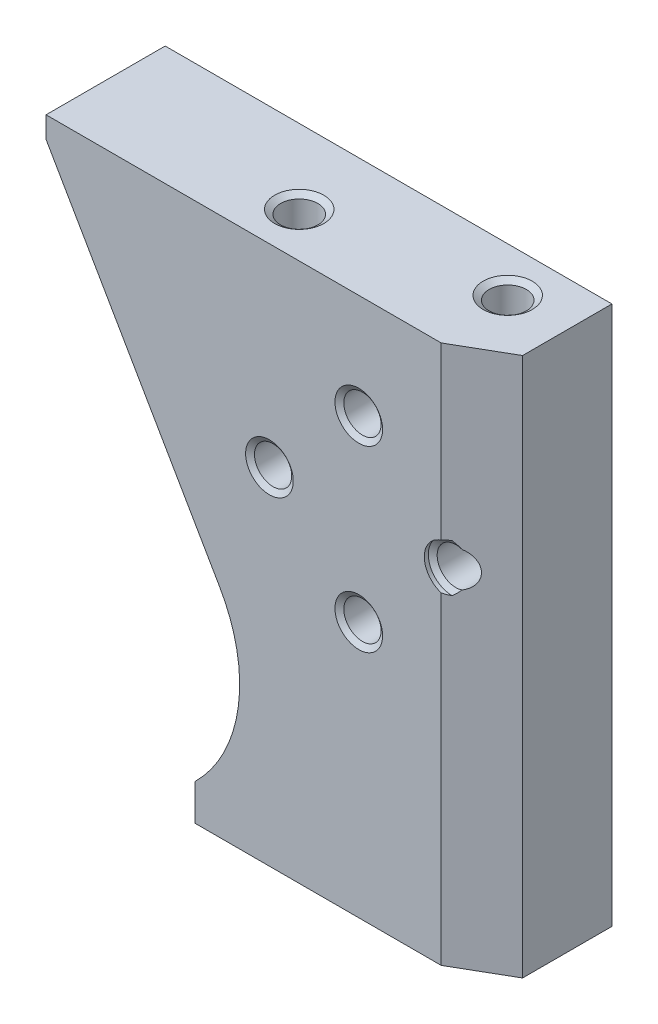
ISO-10303-21;
HEADER;
FILE_DESCRIPTION(('STEP AP214'),'2;1');
FILE_NAME('part.step','',(''),(''),'','','');
FILE_SCHEMA(('AUTOMOTIVE_DESIGN { 1 0 10303 214 1 1 1 1 }'));
ENDSEC;
DATA;
#1=APPLICATION_CONTEXT('core data for automotive mechanical design processes');
#2=APPLICATION_PROTOCOL_DEFINITION('international standard','automotive_design',2000,#1);
#3=PRODUCT_CONTEXT('',#1,'mechanical');
#4=PRODUCT('Part','Part','',(#3));
#5=PRODUCT_RELATED_PRODUCT_CATEGORY('part','',(#4));
#6=PRODUCT_DEFINITION_FORMATION('','',#4);
#7=PRODUCT_DEFINITION_CONTEXT('part definition',#1,'design');
#8=PRODUCT_DEFINITION('design','',#6,#7);
#9=PRODUCT_DEFINITION_SHAPE('','',#8);
#10=(LENGTH_UNIT() NAMED_UNIT(*) SI_UNIT(.MILLI.,.METRE.));
#11=(NAMED_UNIT(*) PLANE_ANGLE_UNIT() SI_UNIT($,.RADIAN.));
#12=(NAMED_UNIT(*) SI_UNIT($,.STERADIAN.) SOLID_ANGLE_UNIT());
#13=UNCERTAINTY_MEASURE_WITH_UNIT(LENGTH_MEASURE(1.E-05),#10,'distance_accuracy_value','');
#14=(GEOMETRIC_REPRESENTATION_CONTEXT(3) GLOBAL_UNCERTAINTY_ASSIGNED_CONTEXT((#13)) GLOBAL_UNIT_ASSIGNED_CONTEXT((#10,
#11,#12)) REPRESENTATION_CONTEXT('',''));
#15=CARTESIAN_POINT('',(0.,0.,0.));
#16=DIRECTION('',(0.,0.,1.));
#17=DIRECTION('',(1.,0.,0.));
#18=AXIS2_PLACEMENT_3D('',#15,#16,#17);
#19=CARTESIAN_POINT('',(0.,0.,8.));
#20=DIRECTION('',(1.,0.,0.));
#21=DIRECTION('',(0.,0.,-1.));
#22=AXIS2_PLACEMENT_3D('',#19,#20,#21);
#23=PLANE('',#22);
#24=DIRECTION('',(0.,-1.,0.));
#25=VECTOR('',#24,1.);
#26=CARTESIAN_POINT('',(0.,0.,0.));
#27=LINE('',#26,#25);
#28=CARTESIAN_POINT('',(0.,36.2,0.));
#29=VERTEX_POINT('',#28);
#30=CARTESIAN_POINT('',(0.,34.7661524227067,0.));
#31=VERTEX_POINT('',#30);
#32=EDGE_CURVE('E188',#29,#31,#27,.T.);
#33=ORIENTED_EDGE('',*,*,#32,.T.);
#34=DIRECTION('',(0.,0.,-1.));
#35=VECTOR('',#34,1.);
#36=CARTESIAN_POINT('',(0.,34.7661524227067,8.));
#37=LINE('',#36,#35);
#38=CARTESIAN_POINT('',(0.,34.7661524227067,8.));
#39=VERTEX_POINT('',#38);
#40=EDGE_CURVE('E192',#39,#31,#37,.T.);
#41=ORIENTED_EDGE('',*,*,#40,.F.);
#42=DIRECTION('',(0.,-1.,0.));
#43=VECTOR('',#42,1.);
#44=CARTESIAN_POINT('',(0.,0.,8.));
#45=LINE('',#44,#43);
#46=CARTESIAN_POINT('',(0.,36.2,8.));
#47=VERTEX_POINT('',#46);
#48=EDGE_CURVE('E179',#47,#39,#45,.T.);
#49=ORIENTED_EDGE('',*,*,#48,.F.);
#50=DIRECTION('',(0.,0.,-1.));
#51=VECTOR('',#50,1.);
#52=CARTESIAN_POINT('',(0.,36.2,8.));
#53=LINE('',#52,#51);
#54=EDGE_CURVE('E181',#47,#29,#53,.T.);
#55=ORIENTED_EDGE('',*,*,#54,.T.);
#56=EDGE_LOOP('',(#33,#41,#49,#55));
#57=FACE_BOUND('',#56,.T.);
#58=ADVANCED_FACE('F33',(#57),#23,.F.);
#59=CARTESIAN_POINT('',(0.,0.,8.));
#60=DIRECTION('',(0.,1.,0.));
#61=DIRECTION('',(0.,0.,1.));
#62=AXIS2_PLACEMENT_3D('',#59,#60,#61);
#63=PLANE('',#62);
#64=CARTESIAN_POINT('',(24.,0.,5.));
#65=DIRECTION('',(0.,-1.,0.));
#66=DIRECTION('',(0.,0.,-1.));
#67=AXIS2_PLACEMENT_3D('',#64,#65,#66);
#68=CIRCLE('',#67,1.65);
#69=CARTESIAN_POINT('',(24.,0.,3.35));
#70=VERTEX_POINT('',#69);
#71=EDGE_CURVE('E432',#70,#70,#68,.T.);
#72=ORIENTED_EDGE('',*,*,#71,.F.);
#73=EDGE_LOOP('',(#72));
#74=FACE_BOUND('',#73,.T.);
#75=CARTESIAN_POINT('',(15.,0.,5.));
#76=DIRECTION('',(0.,-1.,0.));
#77=DIRECTION('',(0.,0.,-1.));
#78=AXIS2_PLACEMENT_3D('',#75,#76,#77);
#79=CIRCLE('',#78,1.65);
#80=CARTESIAN_POINT('',(15.,0.,3.35));
#81=VERTEX_POINT('',#80);
#82=EDGE_CURVE('E441',#81,#81,#79,.T.);
#83=ORIENTED_EDGE('',*,*,#82,.F.);
#84=EDGE_LOOP('',(#83));
#85=FACE_BOUND('',#84,.T.);
#86=DIRECTION('',(0.,0.,-1.));
#87=VECTOR('',#86,1.);
#88=CARTESIAN_POINT('',(30.,0.,8.));
#89=LINE('',#88,#87);
#90=CARTESIAN_POINT('',(30.,0.,6.));
#91=VERTEX_POINT('',#90);
#92=CARTESIAN_POINT('',(30.,0.,0.));
#93=VERTEX_POINT('',#92);
#94=EDGE_CURVE('E153',#91,#93,#89,.T.);
#95=ORIENTED_EDGE('',*,*,#94,.F.);
#96=DIRECTION('',(0.866025403784438,0.,-0.500000000000001));
#97=VECTOR('',#96,1.);
#98=CARTESIAN_POINT('',(26.5358983848623,0.,8.));
#99=LINE('',#98,#97);
#100=CARTESIAN_POINT('',(26.5358983848623,0.,8.));
#101=VERTEX_POINT('',#100);
#102=EDGE_CURVE('E162',#91,#101,#99,.F.);
#103=ORIENTED_EDGE('',*,*,#102,.T.);
#104=DIRECTION('',(1.,0.,0.));
#105=VECTOR('',#104,1.);
#106=CARTESIAN_POINT('',(0.,0.,8.));
#107=LINE('',#106,#105);
#108=CARTESIAN_POINT('',(10.,0.,8.));
#109=VERTEX_POINT('',#108);
#110=EDGE_CURVE('E172',#109,#101,#107,.T.);
#111=ORIENTED_EDGE('',*,*,#110,.F.);
#112=DIRECTION('',(0.,0.,-1.));
#113=VECTOR('',#112,1.);
#114=CARTESIAN_POINT('',(10.,0.,8.));
#115=LINE('',#114,#113);
#116=CARTESIAN_POINT('',(10.,0.,0.));
#117=VERTEX_POINT('',#116);
#118=EDGE_CURVE('E236',#109,#117,#115,.T.);
#119=ORIENTED_EDGE('',*,*,#118,.T.);
#120=DIRECTION('',(1.,0.,0.));
#121=VECTOR('',#120,1.);
#122=CARTESIAN_POINT('',(0.,0.,0.));
#123=LINE('',#122,#121);
#124=EDGE_CURVE('E191',#117,#93,#123,.T.);
#125=ORIENTED_EDGE('',*,*,#124,.T.);
#126=EDGE_LOOP('',(#95,#103,#111,#119,#125));
#127=FACE_BOUND('',#126,.T.);
#128=ADVANCED_FACE('F245',(#74,#85,#127),#63,.F.);
#129=CARTESIAN_POINT('',(30.,0.,8.));
#130=DIRECTION('',(-1.,0.,0.));
#131=DIRECTION('',(0.,0.,1.));
#132=AXIS2_PLACEMENT_3D('',#129,#130,#131);
#133=PLANE('',#132);
#134=DIRECTION('',(0.,0.,-1.));
#135=VECTOR('',#134,1.);
#136=CARTESIAN_POINT('',(30.,36.2,8.));
#137=LINE('',#136,#135);
#138=CARTESIAN_POINT('',(30.,36.2,6.));
#139=VERTEX_POINT('',#138);
#140=CARTESIAN_POINT('',(30.,36.2,0.));
#141=VERTEX_POINT('',#140);
#142=EDGE_CURVE('E156',#139,#141,#137,.T.);
#143=ORIENTED_EDGE('',*,*,#142,.F.);
#144=DIRECTION('',(0.,-1.,0.));
#145=VECTOR('',#144,1.);
#146=CARTESIAN_POINT('',(30.,0.,6.));
#147=LINE('',#146,#145);
#148=EDGE_CURVE('E58',#139,#91,#147,.T.);
#149=ORIENTED_EDGE('',*,*,#148,.T.);
#150=ORIENTED_EDGE('',*,*,#94,.T.);
#151=DIRECTION('',(0.,1.,0.));
#152=VECTOR('',#151,1.);
#153=CARTESIAN_POINT('',(30.,0.,0.));
#154=LINE('',#153,#152);
#155=EDGE_CURVE('E195',#93,#141,#154,.T.);
#156=ORIENTED_EDGE('',*,*,#155,.T.);
#157=EDGE_LOOP('',(#143,#149,#150,#156));
#158=FACE_BOUND('',#157,.T.);
#159=ADVANCED_FACE('F205',(#158),#133,.F.);
#160=CARTESIAN_POINT('',(0.,36.2,8.));
#161=DIRECTION('',(0.,-1.,0.));
#162=DIRECTION('',(0.,0.,-1.));
#163=AXIS2_PLACEMENT_3D('',#160,#161,#162);
#164=PLANE('',#163);
#165=CARTESIAN_POINT('',(14.,36.2,5.));
#166=DIRECTION('',(0.,1.,0.));
#167=DIRECTION('',(0.,0.,1.));
#168=AXIS2_PLACEMENT_3D('',#165,#166,#167);
#169=CIRCLE('',#168,1.65);
#170=CARTESIAN_POINT('',(14.,36.2,6.65));
#171=VERTEX_POINT('',#170);
#172=EDGE_CURVE('E414',#171,#171,#169,.T.);
#173=ORIENTED_EDGE('',*,*,#172,.F.);
#174=EDGE_LOOP('',(#173));
#175=FACE_BOUND('',#174,.T.);
#176=CARTESIAN_POINT('',(26.,36.2,3.));
#177=DIRECTION('',(0.,1.,0.));
#178=DIRECTION('',(0.,0.,1.));
#179=AXIS2_PLACEMENT_3D('',#176,#177,#178);
#180=CIRCLE('',#179,1.65);
#181=CARTESIAN_POINT('',(26.,36.2,4.65));
#182=VERTEX_POINT('',#181);
#183=EDGE_CURVE('E423',#182,#182,#180,.T.);
#184=ORIENTED_EDGE('',*,*,#183,.F.);
#185=EDGE_LOOP('',(#184));
#186=FACE_BOUND('',#185,.T.);
#187=DIRECTION('',(-1.,0.,0.));
#188=VECTOR('',#187,1.);
#189=CARTESIAN_POINT('',(0.,36.2,8.));
#190=LINE('',#189,#188);
#191=CARTESIAN_POINT('',(26.5358983848623,36.2,8.));
#192=VERTEX_POINT('',#191);
#193=EDGE_CURVE('E178',#192,#47,#190,.T.);
#194=ORIENTED_EDGE('',*,*,#193,.F.);
#195=DIRECTION('',(-0.866025403784438,0.,0.500000000000001));
#196=VECTOR('',#195,1.);
#197=CARTESIAN_POINT('',(26.5358983848623,36.2,8.));
#198=LINE('',#197,#196);
#199=EDGE_CURVE('E149',#192,#139,#198,.F.);
#200=ORIENTED_EDGE('',*,*,#199,.T.);
#201=ORIENTED_EDGE('',*,*,#142,.T.);
#202=DIRECTION('',(-1.,0.,0.));
#203=VECTOR('',#202,1.);
#204=CARTESIAN_POINT('',(0.,36.2,0.));
#205=LINE('',#204,#203);
#206=EDGE_CURVE('E184',#141,#29,#205,.T.);
#207=ORIENTED_EDGE('',*,*,#206,.T.);
#208=ORIENTED_EDGE('',*,*,#54,.F.);
#209=EDGE_LOOP('',(#194,#200,#201,#207,#208));
#210=FACE_BOUND('',#209,.T.);
#211=ADVANCED_FACE('F201',(#175,#186,#210),#164,.F.);
#212=CARTESIAN_POINT('',(0.,36.2,8.));
#213=DIRECTION('',(0.,0.,-1.));
#214=DIRECTION('',(-1.,0.,0.));
#215=AXIS2_PLACEMENT_3D('',#212,#213,#214);
#216=PLANE('',#215);
#217=CARTESIAN_POINT('',(21.,29.2,8.));
#218=DIRECTION('',(0.,0.,-1.));
#219=DIRECTION('',(-1.,0.,0.));
#220=AXIS2_PLACEMENT_3D('',#217,#218,#219);
#221=CIRCLE('',#220,1.6);
#222=CARTESIAN_POINT('',(19.4,29.2,8.));
#223=VERTEX_POINT('',#222);
#224=EDGE_CURVE('E375',#223,#223,#221,.T.);
#225=ORIENTED_EDGE('',*,*,#224,.T.);
#226=EDGE_LOOP('',(#225));
#227=FACE_BOUND('',#226,.T.);
#228=CARTESIAN_POINT('',(21.,17.2,8.));
#229=DIRECTION('',(0.,0.,-1.));
#230=DIRECTION('',(-1.,0.,0.));
#231=AXIS2_PLACEMENT_3D('',#228,#229,#230);
#232=CIRCLE('',#231,1.6);
#233=CARTESIAN_POINT('',(19.4,17.2,8.));
#234=VERTEX_POINT('',#233);
#235=EDGE_CURVE('E384',#234,#234,#232,.T.);
#236=ORIENTED_EDGE('',*,*,#235,.T.);
#237=EDGE_LOOP('',(#236));
#238=FACE_BOUND('',#237,.T.);
#239=CARTESIAN_POINT('',(15.,23.2,8.));
#240=DIRECTION('',(0.,0.,-1.));
#241=DIRECTION('',(-1.,0.,0.));
#242=AXIS2_PLACEMENT_3D('',#239,#240,#241);
#243=CIRCLE('',#242,1.6);
#244=CARTESIAN_POINT('',(13.4,23.2,8.));
#245=VERTEX_POINT('',#244);
#246=EDGE_CURVE('E402',#245,#245,#243,.T.);
#247=ORIENTED_EDGE('',*,*,#246,.T.);
#248=EDGE_LOOP('',(#247));
#249=FACE_BOUND('',#248,.T.);
#250=DIRECTION('',(0.,1.,0.));
#251=VECTOR('',#250,1.);
#252=CARTESIAN_POINT('',(26.5358983848623,36.2,8.));
#253=LINE('',#252,#251);
#254=CARTESIAN_POINT('',(26.5358983848623,21.6687881626546,8.));
#255=VERTEX_POINT('',#254);
#256=EDGE_CURVE('E152',#101,#255,#253,.T.);
#257=ORIENTED_EDGE('',*,*,#256,.T.);
#258=CARTESIAN_POINT('',(27.,23.2,8.));
#259=DIRECTION('',(0.,0.,-1.));
#260=DIRECTION('',(-1.,0.,0.));
#261=AXIS2_PLACEMENT_3D('',#258,#259,#260);
#262=CIRCLE('',#261,1.6);
#263=CARTESIAN_POINT('',(26.5358983848623,24.7312118373454,8.));
#264=VERTEX_POINT('',#263);
#265=EDGE_CURVE('E50',#255,#264,#262,.T.);
#266=ORIENTED_EDGE('',*,*,#265,.T.);
#267=EDGE_CURVE('E148',#264,#192,#253,.T.);
#268=ORIENTED_EDGE('',*,*,#267,.T.);
#269=ORIENTED_EDGE('',*,*,#193,.T.);
#270=ORIENTED_EDGE('',*,*,#48,.T.);
#271=DIRECTION('',(0.499999999999998,-0.86602540378444,0.));
#272=VECTOR('',#271,1.);
#273=CARTESIAN_POINT('',(1.78896681474048,31.6675710065216,8.));
#274=LINE('',#273,#272);
#275=CARTESIAN_POINT('',(11.6602540378444,14.57,8.));
#276=VERTEX_POINT('',#275);
#277=EDGE_CURVE('E217',#39,#276,#274,.T.);
#278=ORIENTED_EDGE('',*,*,#277,.T.);
#279=CARTESIAN_POINT('',(3.,9.57,8.));
#280=DIRECTION('',(0.,0.,-1.));
#281=DIRECTION('',(-1.,0.,0.));
#282=AXIS2_PLACEMENT_3D('',#279,#280,#281);
#283=CIRCLE('',#282,10.);
#284=CARTESIAN_POINT('',(10.,2.42857157145715,8.));
#285=VERTEX_POINT('',#284);
#286=EDGE_CURVE('E219',#276,#285,#283,.T.);
#287=ORIENTED_EDGE('',*,*,#286,.T.);
#288=DIRECTION('',(0.,-1.,0.));
#289=VECTOR('',#288,1.);
#290=CARTESIAN_POINT('',(10.,18.1,8.));
#291=LINE('',#290,#289);
#292=EDGE_CURVE('E175',#285,#109,#291,.T.);
#293=ORIENTED_EDGE('',*,*,#292,.T.);
#294=ORIENTED_EDGE('',*,*,#110,.T.);
#295=EDGE_LOOP('',(#257,#266,#268,#269,#270,#278,#287,#293,#294));
#296=FACE_BOUND('',#295,.T.);
#297=ADVANCED_FACE('F169',(#227,#238,#249,#296),#216,.F.);
#298=CARTESIAN_POINT('',(0.,36.2,0.));
#299=DIRECTION('',(0.,0.,-1.));
#300=DIRECTION('',(-1.,0.,0.));
#301=AXIS2_PLACEMENT_3D('',#298,#299,#300);
#302=PLANE('',#301);
#303=CARTESIAN_POINT('',(21.,29.2,0.));
#304=DIRECTION('',(0.,0.,-1.));
#305=DIRECTION('',(-1.,0.,0.));
#306=AXIS2_PLACEMENT_3D('',#303,#304,#305);
#307=CIRCLE('',#306,1.6);
#308=CARTESIAN_POINT('',(19.4,29.2,0.));
#309=VERTEX_POINT('',#308);
#310=EDGE_CURVE('E374',#309,#309,#307,.T.);
#311=ORIENTED_EDGE('',*,*,#310,.F.);
#312=EDGE_LOOP('',(#311));
#313=FACE_BOUND('',#312,.T.);
#314=CARTESIAN_POINT('',(21.,17.2,0.));
#315=DIRECTION('',(0.,0.,-1.));
#316=DIRECTION('',(-1.,0.,0.));
#317=AXIS2_PLACEMENT_3D('',#314,#315,#316);
#318=CIRCLE('',#317,1.6);
#319=CARTESIAN_POINT('',(19.4,17.2,0.));
#320=VERTEX_POINT('',#319);
#321=EDGE_CURVE('E387',#320,#320,#318,.T.);
#322=ORIENTED_EDGE('',*,*,#321,.F.);
#323=EDGE_LOOP('',(#322));
#324=FACE_BOUND('',#323,.T.);
#325=CARTESIAN_POINT('',(27.,23.2,0.));
#326=DIRECTION('',(0.,0.,-1.));
#327=DIRECTION('',(-1.,0.,0.));
#328=AXIS2_PLACEMENT_3D('',#325,#326,#327);
#329=CIRCLE('',#328,1.6);
#330=CARTESIAN_POINT('',(25.4,23.2,0.));
#331=VERTEX_POINT('',#330);
#332=EDGE_CURVE('E143',#331,#331,#329,.T.);
#333=ORIENTED_EDGE('',*,*,#332,.F.);
#334=EDGE_LOOP('',(#333));
#335=FACE_BOUND('',#334,.T.);
#336=CARTESIAN_POINT('',(15.,23.2,0.));
#337=DIRECTION('',(0.,0.,-1.));
#338=DIRECTION('',(-1.,0.,0.));
#339=AXIS2_PLACEMENT_3D('',#336,#337,#338);
#340=CIRCLE('',#339,1.6);
#341=CARTESIAN_POINT('',(13.4,23.2,0.));
#342=VERTEX_POINT('',#341);
#343=EDGE_CURVE('E405',#342,#342,#340,.T.);
#344=ORIENTED_EDGE('',*,*,#343,.F.);
#345=EDGE_LOOP('',(#344));
#346=FACE_BOUND('',#345,.T.);
#347=DIRECTION('',(0.499999999999998,-0.86602540378444,0.));
#348=VECTOR('',#347,1.);
#349=CARTESIAN_POINT('',(1.78896681474048,31.6675710065216,0.));
#350=LINE('',#349,#348);
#351=CARTESIAN_POINT('',(11.6602540378444,14.57,0.));
#352=VERTEX_POINT('',#351);
#353=EDGE_CURVE('E212',#31,#352,#350,.T.);
#354=ORIENTED_EDGE('',*,*,#353,.F.);
#355=ORIENTED_EDGE('',*,*,#32,.F.);
#356=ORIENTED_EDGE('',*,*,#206,.F.);
#357=ORIENTED_EDGE('',*,*,#155,.F.);
#358=ORIENTED_EDGE('',*,*,#124,.F.);
#359=DIRECTION('',(0.,-1.,0.));
#360=VECTOR('',#359,1.);
#361=CARTESIAN_POINT('',(10.,18.1,0.));
#362=LINE('',#361,#360);
#363=CARTESIAN_POINT('',(10.,2.42857157145715,0.));
#364=VERTEX_POINT('',#363);
#365=EDGE_CURVE('E221',#364,#117,#362,.T.);
#366=ORIENTED_EDGE('',*,*,#365,.F.);
#367=CARTESIAN_POINT('',(3.,9.57,0.));
#368=DIRECTION('',(0.,0.,-1.));
#369=DIRECTION('',(-1.,0.,0.));
#370=AXIS2_PLACEMENT_3D('',#367,#368,#369);
#371=CIRCLE('',#370,10.);
#372=EDGE_CURVE('E224',#352,#364,#371,.T.);
#373=ORIENTED_EDGE('',*,*,#372,.F.);
#374=EDGE_LOOP('',(#354,#355,#356,#357,#358,#366,#373));
#375=FACE_BOUND('',#374,.T.);
#376=ADVANCED_FACE('F210',(#313,#324,#335,#346,#375),#302,.T.);
#377=CARTESIAN_POINT('',(1.78896681474048,31.6675710065216,8.));
#378=DIRECTION('',(0.86602540378444,0.499999999999998,0.));
#379=DIRECTION('',(-0.499999999999998,0.86602540378444,0.));
#380=AXIS2_PLACEMENT_3D('',#377,#378,#379);
#381=PLANE('',#380);
#382=ORIENTED_EDGE('',*,*,#353,.T.);
#383=DIRECTION('',(0.,0.,-1.));
#384=VECTOR('',#383,1.);
#385=CARTESIAN_POINT('',(11.6602540378444,14.57,8.));
#386=LINE('',#385,#384);
#387=EDGE_CURVE('E231',#276,#352,#386,.T.);
#388=ORIENTED_EDGE('',*,*,#387,.F.);
#389=ORIENTED_EDGE('',*,*,#277,.F.);
#390=ORIENTED_EDGE('',*,*,#40,.T.);
#391=EDGE_LOOP('',(#382,#388,#389,#390));
#392=FACE_BOUND('',#391,.T.);
#393=ADVANCED_FACE('F262',(#392),#381,.F.);
#394=CARTESIAN_POINT('',(10.,18.1,8.));
#395=DIRECTION('',(1.,0.,0.));
#396=DIRECTION('',(0.,0.,-1.));
#397=AXIS2_PLACEMENT_3D('',#394,#395,#396);
#398=PLANE('',#397);
#399=ORIENTED_EDGE('',*,*,#365,.T.);
#400=ORIENTED_EDGE('',*,*,#118,.F.);
#401=ORIENTED_EDGE('',*,*,#292,.F.);
#402=DIRECTION('',(0.,0.,-1.));
#403=VECTOR('',#402,1.);
#404=CARTESIAN_POINT('',(10.,2.42857157145715,8.));
#405=LINE('',#404,#403);
#406=EDGE_CURVE('E238',#285,#364,#405,.T.);
#407=ORIENTED_EDGE('',*,*,#406,.T.);
#408=EDGE_LOOP('',(#399,#400,#401,#407));
#409=FACE_BOUND('',#408,.T.);
#410=ADVANCED_FACE('F244',(#409),#398,.F.);
#411=CARTESIAN_POINT('',(3.,9.57,8.));
#412=DIRECTION('',(0.,0.,-1.));
#413=DIRECTION('',(-1.,0.,0.));
#414=AXIS2_PLACEMENT_3D('',#411,#412,#413);
#415=CYLINDRICAL_SURFACE('',#414,10.);
#416=ORIENTED_EDGE('',*,*,#372,.T.);
#417=ORIENTED_EDGE('',*,*,#406,.F.);
#418=ORIENTED_EDGE('',*,*,#286,.F.);
#419=ORIENTED_EDGE('',*,*,#387,.T.);
#420=EDGE_LOOP('',(#416,#417,#418,#419));
#421=FACE_BOUND('',#420,.T.);
#422=ADVANCED_FACE('F241',(#421),#415,.F.);
#423=CARTESIAN_POINT('',(26.5358983848623,36.2,8.));
#424=DIRECTION('',(-0.500000000000001,0.,-0.866025403784438));
#425=DIRECTION('',(-0.866025403784438,0.,0.500000000000001));
#426=AXIS2_PLACEMENT_3D('',#423,#424,#425);
#427=PLANE('',#426);
#428=CARTESIAN_POINT('',(27.,23.2,7.73205080756889));
#429=DIRECTION('',(-0.500000000000001,0.,-0.866025403784438));
#430=DIRECTION('',(0.866025403784438,0.,-0.500000000000001));
#431=AXIS2_PLACEMENT_3D('',#428,#429,#430);
#432=ELLIPSE('',#431,1.8475208614068,1.6);
#433=CARTESIAN_POINT('',(27.,24.8,7.73205080756889));
#434=VERTEX_POINT('',#433);
#435=EDGE_CURVE('E11',#434,#264,#432,.F.);
#436=ORIENTED_EDGE('',*,*,#435,.F.);
#437=CARTESIAN_POINT('',(22.878980024513,23.2,10.1113227997522));
#438=DIRECTION('',(-0.500000000000001,0.,-0.866025403784438));
#439=DIRECTION('',(-0.866025403784438,0.,0.500000000000001));
#440=AXIS2_PLACEMENT_3D('',#437,#438,#439);
#441=ELLIPSE('',#440,5.77113850389763,2.8278479600244);
#442=CARTESIAN_POINT('',(27.4244782612077,24.3757202923154,7.48697816919549));
#443=VERTEX_POINT('',#442);
#444=EDGE_CURVE('E42',#443,#434,#441,.F.);
#445=ORIENTED_EDGE('',*,*,#444,.F.);
#446=CARTESIAN_POINT('',(27.,23.2,7.73205080756889));
#447=DIRECTION('',(-0.500000000000001,0.,-0.866025403784438));
#448=DIRECTION('',(0.866025403784438,0.,-0.500000000000001));
#449=AXIS2_PLACEMENT_3D('',#446,#447,#448);
#450=ELLIPSE('',#449,1.44337567297407,1.25);
#451=CARTESIAN_POINT('',(27.4244782612077,22.0242797076847,7.48697816919549));
#452=VERTEX_POINT('',#451);
#453=EDGE_CURVE('E37',#452,#443,#450,.F.);
#454=ORIENTED_EDGE('',*,*,#453,.F.);
#455=CARTESIAN_POINT('',(27.,21.6,7.73205080756889));
#456=VERTEX_POINT('',#455);
#457=EDGE_CURVE('E141',#456,#452,#441,.F.);
#458=ORIENTED_EDGE('',*,*,#457,.F.);
#459=EDGE_CURVE('E44',#255,#456,#432,.F.);
#460=ORIENTED_EDGE('',*,*,#459,.F.);
#461=ORIENTED_EDGE('',*,*,#256,.F.);
#462=ORIENTED_EDGE('',*,*,#102,.F.);
#463=ORIENTED_EDGE('',*,*,#148,.F.);
#464=ORIENTED_EDGE('',*,*,#199,.F.);
#465=ORIENTED_EDGE('',*,*,#267,.F.);
#466=EDGE_LOOP('',(#436,#445,#454,#458,#460,#461,#462,#463,#464,#465));
#467=FACE_BOUND('',#466,.T.);
#468=ADVANCED_FACE('F35',(#467),#427,.F.);
#469=CARTESIAN_POINT('',(15.,10.5,5.));
#470=DIRECTION('',(0.,-1.,0.));
#471=DIRECTION('',(0.,0.,-1.));
#472=AXIS2_PLACEMENT_3D('',#469,#470,#471);
#473=CONICAL_SURFACE('',#472,1.24999999999999,1.02974425867665);
#474=CARTESIAN_POINT('',(15.,11.2510757737844,5.));
#475=VERTEX_POINT('',#474);
#476=VERTEX_LOOP('',#475);
#477=FACE_BOUND('',#476,.T.);
#478=CARTESIAN_POINT('',(15.,10.5,5.));
#479=DIRECTION('',(0.,-1.,0.));
#480=DIRECTION('',(0.,0.,-1.));
#481=AXIS2_PLACEMENT_3D('',#478,#479,#480);
#482=CIRCLE('',#481,1.24999999999999);
#483=CARTESIAN_POINT('',(15.,10.5,3.75000000000001));
#484=VERTEX_POINT('',#483);
#485=EDGE_CURVE('E227',#484,#484,#482,.T.);
#486=ORIENTED_EDGE('',*,*,#485,.T.);
#487=EDGE_LOOP('',(#486));
#488=FACE_BOUND('',#487,.T.);
#489=ADVANCED_FACE('F273',(#477,#488),#473,.F.);
#490=CARTESIAN_POINT('',(15.,0.,5.));
#491=DIRECTION('',(0.,-1.,0.));
#492=DIRECTION('',(0.,0.,-1.));
#493=AXIS2_PLACEMENT_3D('',#490,#491,#492);
#494=CYLINDRICAL_SURFACE('',#493,1.24999999999999);
#495=ORIENTED_EDGE('',*,*,#485,.F.);
#496=EDGE_LOOP('',(#495));
#497=FACE_BOUND('',#496,.T.);
#498=CARTESIAN_POINT('',(15.,0.280083015283884,5.));
#499=DIRECTION('',(0.,-1.,0.));
#500=DIRECTION('',(0.,0.,-1.));
#501=AXIS2_PLACEMENT_3D('',#498,#499,#500);
#502=CIRCLE('',#501,1.25);
#503=CARTESIAN_POINT('',(15.,0.280083015283884,3.75));
#504=VERTEX_POINT('',#503);
#505=EDGE_CURVE('E443',#504,#504,#502,.T.);
#506=ORIENTED_EDGE('',*,*,#505,.T.);
#507=EDGE_LOOP('',(#506));
#508=FACE_BOUND('',#507,.T.);
#509=ADVANCED_FACE('F276',(#497,#508),#494,.F.);
#510=CARTESIAN_POINT('',(15.,0.,5.));
#511=DIRECTION('',(0.,-1.,0.));
#512=DIRECTION('',(0.,0.,-1.));
#513=AXIS2_PLACEMENT_3D('',#510,#511,#512);
#514=CONICAL_SURFACE('',#513,1.65,0.959931088596879);
#515=ORIENTED_EDGE('',*,*,#505,.F.);
#516=EDGE_LOOP('',(#515));
#517=FACE_BOUND('',#516,.T.);
#518=ORIENTED_EDGE('',*,*,#82,.T.);
#519=EDGE_LOOP('',(#518));
#520=FACE_BOUND('',#519,.T.);
#521=ADVANCED_FACE('F280',(#517,#520),#514,.F.);
#522=CARTESIAN_POINT('',(24.,10.5,5.));
#523=DIRECTION('',(0.,-1.,0.));
#524=DIRECTION('',(0.,0.,-1.));
#525=AXIS2_PLACEMENT_3D('',#522,#523,#524);
#526=CONICAL_SURFACE('',#525,1.24999999999999,1.02974425867665);
#527=CARTESIAN_POINT('',(24.,11.2510757737844,5.));
#528=VERTEX_POINT('',#527);
#529=VERTEX_LOOP('',#528);
#530=FACE_BOUND('',#529,.T.);
#531=CARTESIAN_POINT('',(24.,10.5,5.));
#532=DIRECTION('',(0.,-1.,0.));
#533=DIRECTION('',(0.,0.,-1.));
#534=AXIS2_PLACEMENT_3D('',#531,#532,#533);
#535=CIRCLE('',#534,1.24999999999999);
#536=CARTESIAN_POINT('',(24.,10.5,3.75000000000001));
#537=VERTEX_POINT('',#536);
#538=EDGE_CURVE('E438',#537,#537,#535,.T.);
#539=ORIENTED_EDGE('',*,*,#538,.T.);
#540=EDGE_LOOP('',(#539));
#541=FACE_BOUND('',#540,.T.);
#542=ADVANCED_FACE('F284',(#530,#541),#526,.F.);
#543=CARTESIAN_POINT('',(24.,0.,5.));
#544=DIRECTION('',(0.,-1.,0.));
#545=DIRECTION('',(0.,0.,-1.));
#546=AXIS2_PLACEMENT_3D('',#543,#544,#545);
#547=CYLINDRICAL_SURFACE('',#546,1.24999999999999);
#548=ORIENTED_EDGE('',*,*,#538,.F.);
#549=EDGE_LOOP('',(#548));
#550=FACE_BOUND('',#549,.T.);
#551=CARTESIAN_POINT('',(24.,0.280083015283884,5.));
#552=DIRECTION('',(0.,-1.,0.));
#553=DIRECTION('',(0.,0.,-1.));
#554=AXIS2_PLACEMENT_3D('',#551,#552,#553);
#555=CIRCLE('',#554,1.25);
#556=CARTESIAN_POINT('',(24.,0.280083015283884,3.75));
#557=VERTEX_POINT('',#556);
#558=EDGE_CURVE('E435',#557,#557,#555,.T.);
#559=ORIENTED_EDGE('',*,*,#558,.T.);
#560=EDGE_LOOP('',(#559));
#561=FACE_BOUND('',#560,.T.);
#562=ADVANCED_FACE('F288',(#550,#561),#547,.F.);
#563=CARTESIAN_POINT('',(24.,0.,5.));
#564=DIRECTION('',(0.,-1.,0.));
#565=DIRECTION('',(0.,0.,-1.));
#566=AXIS2_PLACEMENT_3D('',#563,#564,#565);
#567=CONICAL_SURFACE('',#566,1.65,0.959931088596879);
#568=ORIENTED_EDGE('',*,*,#558,.F.);
#569=EDGE_LOOP('',(#568));
#570=FACE_BOUND('',#569,.T.);
#571=ORIENTED_EDGE('',*,*,#71,.T.);
#572=EDGE_LOOP('',(#571));
#573=FACE_BOUND('',#572,.T.);
#574=ADVANCED_FACE('F292',(#570,#573),#567,.F.);
#575=CARTESIAN_POINT('',(26.,26.2,3.));
#576=DIRECTION('',(0.,1.,0.));
#577=DIRECTION('',(0.,0.,1.));
#578=AXIS2_PLACEMENT_3D('',#575,#576,#577);
#579=CONICAL_SURFACE('',#578,1.25,1.02974425867665);
#580=CARTESIAN_POINT('',(26.,25.4489242262155,3.));
#581=VERTEX_POINT('',#580);
#582=VERTEX_LOOP('',#581);
#583=FACE_BOUND('',#582,.T.);
#584=CARTESIAN_POINT('',(26.,26.2,3.));
#585=DIRECTION('',(0.,1.,0.));
#586=DIRECTION('',(0.,0.,1.));
#587=AXIS2_PLACEMENT_3D('',#584,#585,#586);
#588=CIRCLE('',#587,1.25);
#589=CARTESIAN_POINT('',(26.,26.2,4.25));
#590=VERTEX_POINT('',#589);
#591=EDGE_CURVE('E429',#590,#590,#588,.T.);
#592=ORIENTED_EDGE('',*,*,#591,.T.);
#593=EDGE_LOOP('',(#592));
#594=FACE_BOUND('',#593,.T.);
#595=ADVANCED_FACE('F296',(#583,#594),#579,.F.);
#596=CARTESIAN_POINT('',(26.,36.2,3.));
#597=DIRECTION('',(0.,1.,0.));
#598=DIRECTION('',(0.,0.,1.));
#599=AXIS2_PLACEMENT_3D('',#596,#597,#598);
#600=CYLINDRICAL_SURFACE('',#599,1.24999999999999);
#601=ORIENTED_EDGE('',*,*,#591,.F.);
#602=EDGE_LOOP('',(#601));
#603=FACE_BOUND('',#602,.T.);
#604=CARTESIAN_POINT('',(26.,35.9199169847161,3.));
#605=DIRECTION('',(0.,1.,0.));
#606=DIRECTION('',(0.,0.,1.));
#607=AXIS2_PLACEMENT_3D('',#604,#605,#606);
#608=CIRCLE('',#607,1.24999999999999);
#609=CARTESIAN_POINT('',(26.,35.9199169847161,4.24999999999999));
#610=VERTEX_POINT('',#609);
#611=EDGE_CURVE('E426',#610,#610,#608,.T.);
#612=ORIENTED_EDGE('',*,*,#611,.T.);
#613=EDGE_LOOP('',(#612));
#614=FACE_BOUND('',#613,.T.);
#615=ADVANCED_FACE('F300',(#603,#614),#600,.F.);
#616=CARTESIAN_POINT('',(26.,36.2,3.));
#617=DIRECTION('',(0.,1.,0.));
#618=DIRECTION('',(0.,0.,1.));
#619=AXIS2_PLACEMENT_3D('',#616,#617,#618);
#620=CONICAL_SURFACE('',#619,1.65,0.959931088596868);
#621=ORIENTED_EDGE('',*,*,#611,.F.);
#622=EDGE_LOOP('',(#621));
#623=FACE_BOUND('',#622,.T.);
#624=ORIENTED_EDGE('',*,*,#183,.T.);
#625=EDGE_LOOP('',(#624));
#626=FACE_BOUND('',#625,.T.);
#627=ADVANCED_FACE('F304',(#623,#626),#620,.F.);
#628=CARTESIAN_POINT('',(14.,26.2,5.));
#629=DIRECTION('',(0.,1.,0.));
#630=DIRECTION('',(0.,0.,1.));
#631=AXIS2_PLACEMENT_3D('',#628,#629,#630);
#632=CONICAL_SURFACE('',#631,1.25,1.02974425867665);
#633=CARTESIAN_POINT('',(14.,25.4489242262155,5.));
#634=VERTEX_POINT('',#633);
#635=VERTEX_LOOP('',#634);
#636=FACE_BOUND('',#635,.T.);
#637=CARTESIAN_POINT('',(14.,26.2,5.));
#638=DIRECTION('',(0.,1.,0.));
#639=DIRECTION('',(0.,0.,1.));
#640=AXIS2_PLACEMENT_3D('',#637,#638,#639);
#641=CIRCLE('',#640,1.25);
#642=CARTESIAN_POINT('',(14.,26.2,6.25));
#643=VERTEX_POINT('',#642);
#644=EDGE_CURVE('E420',#643,#643,#641,.T.);
#645=ORIENTED_EDGE('',*,*,#644,.T.);
#646=EDGE_LOOP('',(#645));
#647=FACE_BOUND('',#646,.T.);
#648=ADVANCED_FACE('F308',(#636,#647),#632,.F.);
#649=CARTESIAN_POINT('',(14.,36.2,5.));
#650=DIRECTION('',(0.,1.,0.));
#651=DIRECTION('',(0.,0.,1.));
#652=AXIS2_PLACEMENT_3D('',#649,#650,#651);
#653=CYLINDRICAL_SURFACE('',#652,1.24999999999999);
#654=ORIENTED_EDGE('',*,*,#644,.F.);
#655=EDGE_LOOP('',(#654));
#656=FACE_BOUND('',#655,.T.);
#657=CARTESIAN_POINT('',(14.,35.9199169847161,5.));
#658=DIRECTION('',(0.,1.,0.));
#659=DIRECTION('',(0.,0.,1.));
#660=AXIS2_PLACEMENT_3D('',#657,#658,#659);
#661=CIRCLE('',#660,1.24999999999999);
#662=CARTESIAN_POINT('',(14.,35.9199169847161,6.24999999999999));
#663=VERTEX_POINT('',#662);
#664=EDGE_CURVE('E417',#663,#663,#661,.T.);
#665=ORIENTED_EDGE('',*,*,#664,.T.);
#666=EDGE_LOOP('',(#665));
#667=FACE_BOUND('',#666,.T.);
#668=ADVANCED_FACE('F312',(#656,#667),#653,.F.);
#669=CARTESIAN_POINT('',(14.,36.2,5.));
#670=DIRECTION('',(0.,1.,0.));
#671=DIRECTION('',(0.,0.,1.));
#672=AXIS2_PLACEMENT_3D('',#669,#670,#671);
#673=CONICAL_SURFACE('',#672,1.65,0.959931088596868);
#674=ORIENTED_EDGE('',*,*,#664,.F.);
#675=EDGE_LOOP('',(#674));
#676=FACE_BOUND('',#675,.T.);
#677=ORIENTED_EDGE('',*,*,#172,.T.);
#678=EDGE_LOOP('',(#677));
#679=FACE_BOUND('',#678,.T.);
#680=ADVANCED_FACE('F316',(#676,#679),#673,.F.);
#681=CARTESIAN_POINT('',(15.,23.2,7.75492736162661));
#682=DIRECTION('',(0.,0.,1.));
#683=DIRECTION('',(1.,0.,0.));
#684=AXIS2_PLACEMENT_3D('',#681,#682,#683);
#685=CONICAL_SURFACE('',#684,1.25,0.959931088596881);
#686=ORIENTED_EDGE('',*,*,#246,.F.);
#687=EDGE_LOOP('',(#686));
#688=FACE_BOUND('',#687,.T.);
#689=CARTESIAN_POINT('',(15.,23.2,7.75492736162661));
#690=DIRECTION('',(0.,0.,-1.));
#691=DIRECTION('',(-1.,0.,0.));
#692=AXIS2_PLACEMENT_3D('',#689,#690,#691);
#693=CIRCLE('',#692,1.25);
#694=CARTESIAN_POINT('',(13.75,23.2,7.75492736162661));
#695=VERTEX_POINT('',#694);
#696=EDGE_CURVE('E411',#695,#695,#693,.T.);
#697=ORIENTED_EDGE('',*,*,#696,.T.);
#698=EDGE_LOOP('',(#697));
#699=FACE_BOUND('',#698,.T.);
#700=ADVANCED_FACE('F320',(#688,#699),#685,.F.);
#701=CARTESIAN_POINT('',(15.,23.2,0.));
#702=DIRECTION('',(0.,0.,-1.));
#703=DIRECTION('',(-1.,0.,0.));
#704=AXIS2_PLACEMENT_3D('',#701,#702,#703);
#705=CYLINDRICAL_SURFACE('',#704,1.25);
#706=ORIENTED_EDGE('',*,*,#696,.F.);
#707=EDGE_LOOP('',(#706));
#708=FACE_BOUND('',#707,.T.);
#709=CARTESIAN_POINT('',(15.,23.2,0.245072638373398));
#710=DIRECTION('',(0.,0.,-1.));
#711=DIRECTION('',(-1.,0.,0.));
#712=AXIS2_PLACEMENT_3D('',#709,#710,#711);
#713=CIRCLE('',#712,1.25);
#714=CARTESIAN_POINT('',(13.75,23.2,0.245072638373398));
#715=VERTEX_POINT('',#714);
#716=EDGE_CURVE('E408',#715,#715,#713,.T.);
#717=ORIENTED_EDGE('',*,*,#716,.T.);
#718=EDGE_LOOP('',(#717));
#719=FACE_BOUND('',#718,.T.);
#720=ADVANCED_FACE('F324',(#708,#719),#705,.F.);
#721=CARTESIAN_POINT('',(15.,23.2,0.));
#722=DIRECTION('',(0.,0.,-1.));
#723=DIRECTION('',(-1.,0.,0.));
#724=AXIS2_PLACEMENT_3D('',#721,#722,#723);
#725=CONICAL_SURFACE('',#724,1.6,0.959931088596878);
#726=ORIENTED_EDGE('',*,*,#716,.F.);
#727=EDGE_LOOP('',(#726));
#728=FACE_BOUND('',#727,.T.);
#729=ORIENTED_EDGE('',*,*,#343,.T.);
#730=EDGE_LOOP('',(#729));
#731=FACE_BOUND('',#730,.T.);
#732=ADVANCED_FACE('F328',(#728,#731),#725,.F.);
#733=CARTESIAN_POINT('',(27.,23.2,7.48697816919549));
#734=DIRECTION('',(0.,0.,1.));
#735=DIRECTION('',(1.,0.,0.));
#736=AXIS2_PLACEMENT_3D('',#733,#734,#735);
#737=CONICAL_SURFACE('',#736,1.25,0.959931088596879);
#738=ORIENTED_EDGE('',*,*,#457,.T.);
#739=CARTESIAN_POINT('',(27.,23.2,7.48697816919549));
#740=DIRECTION('',(0.,0.,-1.));
#741=DIRECTION('',(-1.,0.,0.));
#742=AXIS2_PLACEMENT_3D('',#739,#740,#741);
#743=CIRCLE('',#742,1.25);
#744=EDGE_CURVE('E137',#452,#443,#743,.T.);
#745=ORIENTED_EDGE('',*,*,#744,.T.);
#746=ORIENTED_EDGE('',*,*,#444,.T.);
#747=CARTESIAN_POINT('',(27.,23.2,7.73205080756889));
#748=DIRECTION('',(0.,0.,-1.));
#749=DIRECTION('',(-1.,0.,0.));
#750=AXIS2_PLACEMENT_3D('',#747,#748,#749);
#751=CIRCLE('',#750,1.6);
#752=EDGE_CURVE('E134',#456,#434,#751,.T.);
#753=ORIENTED_EDGE('',*,*,#752,.F.);
#754=EDGE_LOOP('',(#738,#745,#746,#753));
#755=FACE_BOUND('',#754,.T.);
#756=ADVANCED_FACE('F133',(#755),#737,.F.);
#757=CARTESIAN_POINT('',(27.,23.2,0.));
#758=DIRECTION('',(0.,0.,-1.));
#759=DIRECTION('',(-1.,0.,0.));
#760=AXIS2_PLACEMENT_3D('',#757,#758,#759);
#761=CYLINDRICAL_SURFACE('',#760,1.25);
#762=ORIENTED_EDGE('',*,*,#453,.T.);
#763=ORIENTED_EDGE('',*,*,#744,.F.);
#764=EDGE_LOOP('',(#762,#763));
#765=FACE_BOUND('',#764,.T.);
#766=CARTESIAN_POINT('',(27.,23.2,0.245072638373398));
#767=DIRECTION('',(0.,0.,-1.));
#768=DIRECTION('',(-1.,0.,0.));
#769=AXIS2_PLACEMENT_3D('',#766,#767,#768);
#770=CIRCLE('',#769,1.25);
#771=CARTESIAN_POINT('',(25.75,23.2,0.245072638373398));
#772=VERTEX_POINT('',#771);
#773=EDGE_CURVE('E397',#772,#772,#770,.T.);
#774=ORIENTED_EDGE('',*,*,#773,.T.);
#775=EDGE_LOOP('',(#774));
#776=FACE_BOUND('',#775,.T.);
#777=ADVANCED_FACE('F164',(#765,#776),#761,.F.);
#778=CARTESIAN_POINT('',(27.,23.2,0.));
#779=DIRECTION('',(0.,0.,-1.));
#780=DIRECTION('',(-1.,0.,0.));
#781=AXIS2_PLACEMENT_3D('',#778,#779,#780);
#782=CONICAL_SURFACE('',#781,1.6,0.959931088596878);
#783=ORIENTED_EDGE('',*,*,#773,.F.);
#784=EDGE_LOOP('',(#783));
#785=FACE_BOUND('',#784,.T.);
#786=ORIENTED_EDGE('',*,*,#332,.T.);
#787=EDGE_LOOP('',(#786));
#788=FACE_BOUND('',#787,.T.);
#789=ADVANCED_FACE('F337',(#785,#788),#782,.F.);
#790=CARTESIAN_POINT('',(27.,23.2,7.73205080756889));
#791=DIRECTION('',(0.,0.,-1.));
#792=DIRECTION('',(-1.,0.,0.));
#793=AXIS2_PLACEMENT_3D('',#790,#791,#792);
#794=CYLINDRICAL_SURFACE('',#793,1.6);
#795=ORIENTED_EDGE('',*,*,#435,.T.);
#796=ORIENTED_EDGE('',*,*,#265,.F.);
#797=ORIENTED_EDGE('',*,*,#459,.T.);
#798=ORIENTED_EDGE('',*,*,#752,.T.);
#799=EDGE_LOOP('',(#795,#796,#797,#798));
#800=FACE_BOUND('',#799,.T.);
#801=ADVANCED_FACE('F142',(#800),#794,.F.);
#802=CARTESIAN_POINT('',(21.,17.2,7.7549273616266));
#803=DIRECTION('',(0.,0.,1.));
#804=DIRECTION('',(1.,0.,0.));
#805=AXIS2_PLACEMENT_3D('',#802,#803,#804);
#806=CONICAL_SURFACE('',#805,1.25,0.959931088596878);
#807=ORIENTED_EDGE('',*,*,#235,.F.);
#808=EDGE_LOOP('',(#807));
#809=FACE_BOUND('',#808,.T.);
#810=CARTESIAN_POINT('',(21.,17.2,7.7549273616266));
#811=DIRECTION('',(0.,0.,-1.));
#812=DIRECTION('',(-1.,0.,0.));
#813=AXIS2_PLACEMENT_3D('',#810,#811,#812);
#814=CIRCLE('',#813,1.25);
#815=CARTESIAN_POINT('',(19.75,17.2,7.7549273616266));
#816=VERTEX_POINT('',#815);
#817=EDGE_CURVE('E144',#816,#816,#814,.T.);
#818=ORIENTED_EDGE('',*,*,#817,.T.);
#819=EDGE_LOOP('',(#818));
#820=FACE_BOUND('',#819,.T.);
#821=ADVANCED_FACE('F343',(#809,#820),#806,.F.);
#822=CARTESIAN_POINT('',(21.,17.2,0.));
#823=DIRECTION('',(0.,0.,-1.));
#824=DIRECTION('',(-1.,0.,0.));
#825=AXIS2_PLACEMENT_3D('',#822,#823,#824);
#826=CYLINDRICAL_SURFACE('',#825,1.25);
#827=ORIENTED_EDGE('',*,*,#817,.F.);
#828=EDGE_LOOP('',(#827));
#829=FACE_BOUND('',#828,.T.);
#830=CARTESIAN_POINT('',(21.,17.2,0.245072638373398));
#831=DIRECTION('',(0.,0.,-1.));
#832=DIRECTION('',(-1.,0.,0.));
#833=AXIS2_PLACEMENT_3D('',#830,#831,#832);
#834=CIRCLE('',#833,1.25);
#835=CARTESIAN_POINT('',(19.75,17.2,0.245072638373398));
#836=VERTEX_POINT('',#835);
#837=EDGE_CURVE('E390',#836,#836,#834,.T.);
#838=ORIENTED_EDGE('',*,*,#837,.T.);
#839=EDGE_LOOP('',(#838));
#840=FACE_BOUND('',#839,.T.);
#841=ADVANCED_FACE('F346',(#829,#840),#826,.F.);
#842=CARTESIAN_POINT('',(21.,17.2,0.));
#843=DIRECTION('',(0.,0.,-1.));
#844=DIRECTION('',(-1.,0.,0.));
#845=AXIS2_PLACEMENT_3D('',#842,#843,#844);
#846=CONICAL_SURFACE('',#845,1.6,0.959931088596878);
#847=ORIENTED_EDGE('',*,*,#837,.F.);
#848=EDGE_LOOP('',(#847));
#849=FACE_BOUND('',#848,.T.);
#850=ORIENTED_EDGE('',*,*,#321,.T.);
#851=EDGE_LOOP('',(#850));
#852=FACE_BOUND('',#851,.T.);
#853=ADVANCED_FACE('F350',(#849,#852),#846,.F.);
#854=CARTESIAN_POINT('',(21.,29.2,7.7549273616266));
#855=DIRECTION('',(0.,0.,1.));
#856=DIRECTION('',(1.,0.,0.));
#857=AXIS2_PLACEMENT_3D('',#854,#855,#856);
#858=CONICAL_SURFACE('',#857,1.25,0.959931088596878);
#859=ORIENTED_EDGE('',*,*,#224,.F.);
#860=EDGE_LOOP('',(#859));
#861=FACE_BOUND('',#860,.T.);
#862=CARTESIAN_POINT('',(21.,29.2,7.7549273616266));
#863=DIRECTION('',(0.,0.,-1.));
#864=DIRECTION('',(-1.,0.,0.));
#865=AXIS2_PLACEMENT_3D('',#862,#863,#864);
#866=CIRCLE('',#865,1.25);
#867=CARTESIAN_POINT('',(19.75,29.2,7.7549273616266));
#868=VERTEX_POINT('',#867);
#869=EDGE_CURVE('E377',#868,#868,#866,.T.);
#870=ORIENTED_EDGE('',*,*,#869,.T.);
#871=EDGE_LOOP('',(#870));
#872=FACE_BOUND('',#871,.T.);
#873=ADVANCED_FACE('F354',(#861,#872),#858,.F.);
#874=CARTESIAN_POINT('',(21.,29.2,0.));
#875=DIRECTION('',(0.,0.,-1.));
#876=DIRECTION('',(-1.,0.,0.));
#877=AXIS2_PLACEMENT_3D('',#874,#875,#876);
#878=CYLINDRICAL_SURFACE('',#877,1.25);
#879=ORIENTED_EDGE('',*,*,#869,.F.);
#880=EDGE_LOOP('',(#879));
#881=FACE_BOUND('',#880,.T.);
#882=CARTESIAN_POINT('',(21.,29.2,0.245072638373398));
#883=DIRECTION('',(0.,0.,-1.));
#884=DIRECTION('',(-1.,0.,0.));
#885=AXIS2_PLACEMENT_3D('',#882,#883,#884);
#886=CIRCLE('',#885,1.25);
#887=CARTESIAN_POINT('',(19.75,29.2,0.245072638373398));
#888=VERTEX_POINT('',#887);
#889=EDGE_CURVE('E371',#888,#888,#886,.T.);
#890=ORIENTED_EDGE('',*,*,#889,.T.);
#891=EDGE_LOOP('',(#890));
#892=FACE_BOUND('',#891,.T.);
#893=ADVANCED_FACE('F358',(#881,#892),#878,.F.);
#894=CARTESIAN_POINT('',(21.,29.2,0.));
#895=DIRECTION('',(0.,0.,-1.));
#896=DIRECTION('',(-1.,0.,0.));
#897=AXIS2_PLACEMENT_3D('',#894,#895,#896);
#898=CONICAL_SURFACE('',#897,1.6,0.959931088596878);
#899=ORIENTED_EDGE('',*,*,#889,.F.);
#900=EDGE_LOOP('',(#899));
#901=FACE_BOUND('',#900,.T.);
#902=ORIENTED_EDGE('',*,*,#310,.T.);
#903=EDGE_LOOP('',(#902));
#904=FACE_BOUND('',#903,.T.);
#905=ADVANCED_FACE('F362',(#901,#904),#898,.F.);
#906=CLOSED_SHELL('',(#58,#128,#159,#211,#297,#376,#393,#410,#422,#468,#489,#509,#521,#542,#562,
#574,#595,#615,#627,#648,#668,#680,#700,#720,#732,#756,#777,#789,#801,#821,#841,#853,#873,#893,#905));
#907=MANIFOLD_SOLID_BREP('B2',#906);
#908=ADVANCED_BREP_SHAPE_REPRESENTATION('',(#18,#907),#14);
#909=SHAPE_DEFINITION_REPRESENTATION(#9,#908);
ENDSEC;
END-ISO-10303-21;
